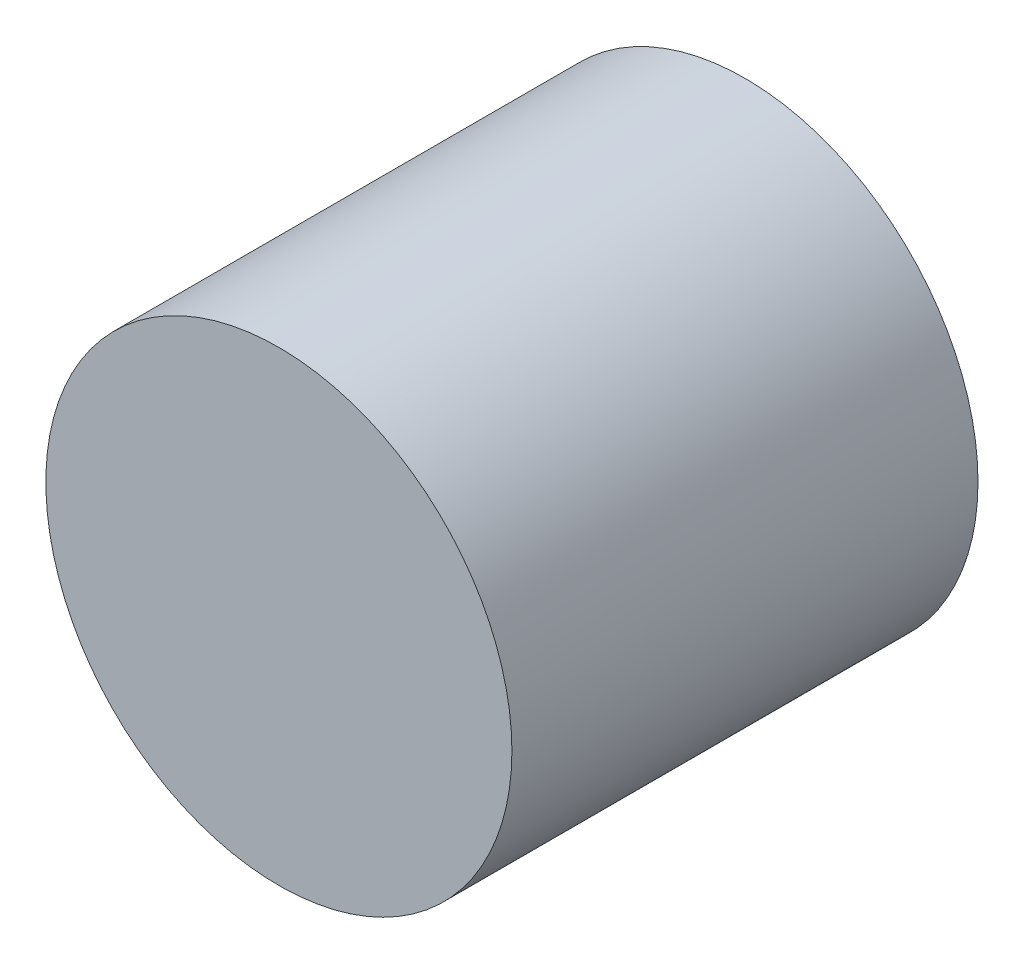
ISO-10303-21;
HEADER;
FILE_DESCRIPTION(('STEP AP214'),'2;1');
FILE_NAME('part.step','',(''),(''),'','','');
FILE_SCHEMA(('AUTOMOTIVE_DESIGN { 1 0 10303 214 1 1 1 1 }'));
ENDSEC;
DATA;
#1=APPLICATION_CONTEXT('core data for automotive mechanical design processes');
#2=APPLICATION_PROTOCOL_DEFINITION('international standard','automotive_design',2000,#1);
#3=PRODUCT_CONTEXT('',#1,'mechanical');
#4=PRODUCT('Part','Part','',(#3));
#5=PRODUCT_RELATED_PRODUCT_CATEGORY('part','',(#4));
#6=PRODUCT_DEFINITION_FORMATION('','',#4);
#7=PRODUCT_DEFINITION_CONTEXT('part definition',#1,'design');
#8=PRODUCT_DEFINITION('design','',#6,#7);
#9=PRODUCT_DEFINITION_SHAPE('','',#8);
#10=(LENGTH_UNIT() NAMED_UNIT(*) SI_UNIT(.MILLI.,.METRE.));
#11=(NAMED_UNIT(*) PLANE_ANGLE_UNIT() SI_UNIT($,.RADIAN.));
#12=(NAMED_UNIT(*) SI_UNIT($,.STERADIAN.) SOLID_ANGLE_UNIT());
#13=UNCERTAINTY_MEASURE_WITH_UNIT(LENGTH_MEASURE(1.E-05),#10,'distance_accuracy_value','');
#14=(GEOMETRIC_REPRESENTATION_CONTEXT(3) GLOBAL_UNCERTAINTY_ASSIGNED_CONTEXT((#13)) GLOBAL_UNIT_ASSIGNED_CONTEXT((#10,
#11,#12)) REPRESENTATION_CONTEXT('',''));
#15=CARTESIAN_POINT('',(0.,0.,0.));
#16=DIRECTION('',(0.,0.,1.));
#17=DIRECTION('',(1.,0.,0.));
#18=AXIS2_PLACEMENT_3D('',#15,#16,#17);
#19=CARTESIAN_POINT('',(0.,0.,1.));
#20=DIRECTION('',(0.,0.,-1.));
#21=DIRECTION('',(-1.,0.,0.));
#22=AXIS2_PLACEMENT_3D('',#19,#20,#21);
#23=CYLINDRICAL_SURFACE('',#22,0.5);
#24=CARTESIAN_POINT('',(0.,0.,1.));
#25=DIRECTION('',(0.,0.,1.));
#26=DIRECTION('',(1.,0.,0.));
#27=AXIS2_PLACEMENT_3D('',#24,#25,#26);
#28=CIRCLE('',#27,0.5);
#29=CARTESIAN_POINT('',(0.5,0.,1.));
#30=VERTEX_POINT('',#29);
#31=EDGE_CURVE('E10',#30,#30,#28,.T.);
#32=ORIENTED_EDGE('',*,*,#31,.F.);
#33=EDGE_LOOP('',(#32));
#34=FACE_BOUND('',#33,.T.);
#35=CARTESIAN_POINT('',(0.,0.,0.));
#36=DIRECTION('',(0.,0.,1.));
#37=DIRECTION('',(1.,0.,0.));
#38=AXIS2_PLACEMENT_3D('',#35,#36,#37);
#39=CIRCLE('',#38,0.5);
#40=CARTESIAN_POINT('',(0.5,0.,0.));
#41=VERTEX_POINT('',#40);
#42=EDGE_CURVE('E37',#41,#41,#39,.T.);
#43=ORIENTED_EDGE('',*,*,#42,.T.);
#44=EDGE_LOOP('',(#43));
#45=FACE_BOUND('',#44,.T.);
#46=ADVANCED_FACE('F34',(#34,#45),#23,.T.);
#47=CARTESIAN_POINT('',(0.,0.,1.));
#48=DIRECTION('',(0.,0.,1.));
#49=DIRECTION('',(1.,0.,0.));
#50=AXIS2_PLACEMENT_3D('',#47,#48,#49);
#51=PLANE('',#50);
#52=ORIENTED_EDGE('',*,*,#31,.T.);
#53=EDGE_LOOP('',(#52));
#54=FACE_BOUND('',#53,.T.);
#55=ADVANCED_FACE('F49',(#54),#51,.T.);
#56=CARTESIAN_POINT('',(0.,0.,0.));
#57=DIRECTION('',(0.,0.,1.));
#58=DIRECTION('',(1.,0.,0.));
#59=AXIS2_PLACEMENT_3D('',#56,#57,#58);
#60=PLANE('',#59);
#61=ORIENTED_EDGE('',*,*,#42,.F.);
#62=EDGE_LOOP('',(#61));
#63=FACE_BOUND('',#62,.T.);
#64=ADVANCED_FACE('F47',(#63),#60,.F.);
#65=CLOSED_SHELL('',(#46,#55,#64));
#66=MANIFOLD_SOLID_BREP('B2',#65);
#67=ADVANCED_BREP_SHAPE_REPRESENTATION('',(#18,#66),#14);
#68=SHAPE_DEFINITION_REPRESENTATION(#9,#67);
ENDSEC;
END-ISO-10303-21;
